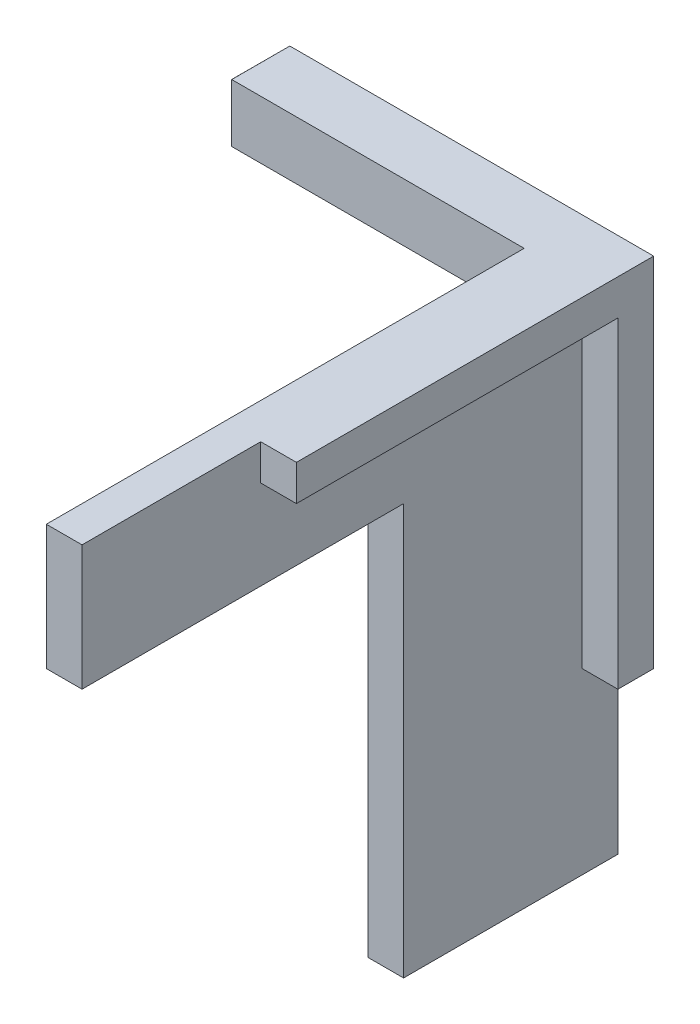
ISO-10303-21;
HEADER;
FILE_DESCRIPTION(('STEP AP214'),'2;1');
FILE_NAME('part.step','',(''),(''),'','','');
FILE_SCHEMA(('AUTOMOTIVE_DESIGN { 1 0 10303 214 1 1 1 1 }'));
ENDSEC;
DATA;
#1=APPLICATION_CONTEXT('core data for automotive mechanical design processes');
#2=APPLICATION_PROTOCOL_DEFINITION('international standard','automotive_design',2000,#1);
#3=PRODUCT_CONTEXT('',#1,'mechanical');
#4=PRODUCT('Part','Part','',(#3));
#5=PRODUCT_RELATED_PRODUCT_CATEGORY('part','',(#4));
#6=PRODUCT_DEFINITION_FORMATION('','',#4);
#7=PRODUCT_DEFINITION_CONTEXT('part definition',#1,'design');
#8=PRODUCT_DEFINITION('design','',#6,#7);
#9=PRODUCT_DEFINITION_SHAPE('','',#8);
#10=(LENGTH_UNIT() NAMED_UNIT(*) SI_UNIT(.MILLI.,.METRE.));
#11=(NAMED_UNIT(*) PLANE_ANGLE_UNIT() SI_UNIT($,.RADIAN.));
#12=(NAMED_UNIT(*) SI_UNIT($,.STERADIAN.) SOLID_ANGLE_UNIT());
#13=UNCERTAINTY_MEASURE_WITH_UNIT(LENGTH_MEASURE(1.E-05),#10,'distance_accuracy_value','');
#14=(GEOMETRIC_REPRESENTATION_CONTEXT(3) GLOBAL_UNCERTAINTY_ASSIGNED_CONTEXT((#13)) GLOBAL_UNIT_ASSIGNED_CONTEXT((#10,
#11,#12)) REPRESENTATION_CONTEXT('',''));
#15=CARTESIAN_POINT('',(0.,0.,0.));
#16=DIRECTION('',(0.,0.,1.));
#17=DIRECTION('',(1.,0.,0.));
#18=AXIS2_PLACEMENT_3D('',#15,#16,#17);
#19=CARTESIAN_POINT('',(168.563384776703,6.86000000004866,-0.499999999998285));
#20=DIRECTION('',(-1.,-2.88657986402541E-13,0.));
#21=DIRECTION('',(2.88657986402541E-13,-1.,0.));
#22=AXIS2_PLACEMENT_3D('',#19,#20,#21);
#23=PLANE('',#22);
#24=DIRECTION('',(0.,0.,-1.));
#25=VECTOR('',#24,1.);
#26=CARTESIAN_POINT('',(168.56338477669,54.0794739282967,-31.5542925575226));
#27=LINE('',#26,#25);
#28=CARTESIAN_POINT('',(168.56338477669,54.0794739282967,-31.5542925575226));
#29=VERTEX_POINT('',#28);
#30=CARTESIAN_POINT('',(168.56338477669,54.0794739282967,-33.5542925575226));
#31=VERTEX_POINT('',#30);
#32=EDGE_CURVE('E249',#29,#31,#27,.T.);
#33=ORIENTED_EDGE('',*,*,#32,.F.);
#34=DIRECTION('',(2.88349591117923E-13,-1.,0.));
#35=VECTOR('',#34,1.);
#36=CARTESIAN_POINT('',(168.563384776685,72.0794739282967,-31.5542925575226));
#37=LINE('',#36,#35);
#38=CARTESIAN_POINT('',(168.563384776685,72.0794739282967,-31.5542925575226));
#39=VERTEX_POINT('',#38);
#40=EDGE_CURVE('E272',#39,#29,#37,.T.);
#41=ORIENTED_EDGE('',*,*,#40,.F.);
#42=DIRECTION('',(0.,0.,-1.));
#43=VECTOR('',#42,1.);
#44=CARTESIAN_POINT('',(168.563384776684,72.0794739282967,-13.5542925575226));
#45=LINE('',#44,#43);
#46=CARTESIAN_POINT('',(168.563384776684,72.0794739282967,-13.5542925575226));
#47=VERTEX_POINT('',#46);
#48=EDGE_CURVE('E268',#47,#39,#45,.T.);
#49=ORIENTED_EDGE('',*,*,#48,.F.);
#50=DIRECTION('',(2.91433543964103E-13,-1.,0.));
#51=VECTOR('',#50,1.);
#52=CARTESIAN_POINT('',(168.563384776684,74.0794739282967,-13.5542925575226));
#53=LINE('',#52,#51);
#54=CARTESIAN_POINT('',(168.563384776684,74.0794739282967,-13.5542925575226));
#55=VERTEX_POINT('',#54);
#56=EDGE_CURVE('E220',#55,#47,#53,.T.);
#57=ORIENTED_EDGE('',*,*,#56,.F.);
#58=DIRECTION('',(0.,0.,1.));
#59=VECTOR('',#58,1.);
#60=CARTESIAN_POINT('',(168.563384776684,74.0794739282967,-3.55429255752262));
#61=LINE('',#60,#59);
#62=CARTESIAN_POINT('',(168.563384776684,74.0794739282967,-3.55429255752262));
#63=VERTEX_POINT('',#62);
#64=EDGE_CURVE('E300',#55,#63,#61,.T.);
#65=ORIENTED_EDGE('',*,*,#64,.T.);
#66=DIRECTION('',(2.88657986402541E-13,-1.,0.));
#67=VECTOR('',#66,1.);
#68=CARTESIAN_POINT('',(168.563384776687,64.0794739282967,-3.55429255752262));
#69=LINE('',#68,#67);
#70=CARTESIAN_POINT('',(168.563384776686,67.0794739282967,-3.55429255752262));
#71=VERTEX_POINT('',#70);
#72=EDGE_CURVE('E184',#63,#71,#69,.T.);
#73=ORIENTED_EDGE('',*,*,#72,.T.);
#74=DIRECTION('',(0.,0.,-1.));
#75=VECTOR('',#74,1.);
#76=CARTESIAN_POINT('',(168.563384776686,67.0794739282967,-3.55429255752262));
#77=LINE('',#76,#75);
#78=CARTESIAN_POINT('',(168.563384776686,67.0794739282967,-21.5542925575226));
#79=VERTEX_POINT('',#78);
#80=EDGE_CURVE('E164',#71,#79,#77,.T.);
#81=ORIENTED_EDGE('',*,*,#80,.T.);
#82=DIRECTION('',(2.88657986402541E-13,-1.,0.));
#83=VECTOR('',#82,1.);
#84=CARTESIAN_POINT('',(168.563384776687,64.0794739282967,-21.5542925575226));
#85=LINE('',#84,#83);
#86=CARTESIAN_POINT('',(168.563384776693,44.0794739282967,-21.5542925575226));
#87=VERTEX_POINT('',#86);
#88=EDGE_CURVE('E176',#79,#87,#85,.T.);
#89=ORIENTED_EDGE('',*,*,#88,.T.);
#90=DIRECTION('',(0.,0.,-1.));
#91=VECTOR('',#90,1.);
#92=CARTESIAN_POINT('',(168.563384776693,44.0794739282967,-33.5542925575226));
#93=LINE('',#92,#91);
#94=CARTESIAN_POINT('',(168.563384776693,44.0794739282967,-33.5542925575226));
#95=VERTEX_POINT('',#94);
#96=EDGE_CURVE('E181',#87,#95,#93,.T.);
#97=ORIENTED_EDGE('',*,*,#96,.T.);
#98=DIRECTION('',(-2.87732800548686E-13,1.,0.));
#99=VECTOR('',#98,1.);
#100=CARTESIAN_POINT('',(168.563384776684,74.0794739282967,-33.5542925575226));
#101=LINE('',#100,#99);
#102=EDGE_CURVE('E311',#95,#31,#101,.T.);
#103=ORIENTED_EDGE('',*,*,#102,.T.);
#104=EDGE_LOOP('',(#33,#41,#49,#57,#65,#73,#81,#89,#97,#103));
#105=FACE_BOUND('',#104,.T.);
#106=ADVANCED_FACE('F47',(#105),#23,.F.);
#107=CARTESIAN_POINT('',(166.563384776687,64.0794739282961,-3.55429255752264));
#108=DIRECTION('',(0.,0.,1.));
#109=DIRECTION('',(1.,0.,0.));
#110=AXIS2_PLACEMENT_3D('',#107,#108,#109);
#111=PLANE('',#110);
#112=ORIENTED_EDGE('',*,*,#72,.F.);
#113=DIRECTION('',(1.,2.87857945530399E-13,0.));
#114=VECTOR('',#113,1.);
#115=CARTESIAN_POINT('',(166.563384776684,74.0794739282961,-3.55429255752264));
#116=LINE('',#115,#114);
#117=CARTESIAN_POINT('',(166.563384776684,74.0794739282961,-3.55429255752264));
#118=VERTEX_POINT('',#117);
#119=EDGE_CURVE('E11',#118,#63,#116,.T.);
#120=ORIENTED_EDGE('',*,*,#119,.F.);
#121=DIRECTION('',(2.88657986402541E-13,-1.,0.));
#122=VECTOR('',#121,1.);
#123=CARTESIAN_POINT('',(166.563384776687,64.0794739282961,-3.55429255752264));
#124=LINE('',#123,#122);
#125=CARTESIAN_POINT('',(166.563384776686,67.0794739282961,-3.55429255752264));
#126=VERTEX_POINT('',#125);
#127=EDGE_CURVE('E196',#118,#126,#124,.T.);
#128=ORIENTED_EDGE('',*,*,#127,.T.);
#129=DIRECTION('',(1.,2.87857945530399E-13,0.));
#130=VECTOR('',#129,1.);
#131=CARTESIAN_POINT('',(166.563384776686,67.0794739282961,-3.55429255752264));
#132=LINE('',#131,#130);
#133=EDGE_CURVE('E173',#126,#71,#132,.T.);
#134=ORIENTED_EDGE('',*,*,#133,.T.);
#135=EDGE_LOOP('',(#112,#120,#128,#134));
#136=FACE_BOUND('',#135,.T.);
#137=ADVANCED_FACE('F322',(#136),#111,.T.);
#138=CARTESIAN_POINT('',(166.563384776684,74.0794739282961,-3.55429255752264));
#139=DIRECTION('',(-2.87857945530399E-13,1.,0.));
#140=DIRECTION('',(-1.,-2.87857945530399E-13,0.));
#141=AXIS2_PLACEMENT_3D('',#138,#139,#140);
#142=PLANE('',#141);
#143=ORIENTED_EDGE('',*,*,#64,.F.);
#144=DIRECTION('',(-1.,-2.88657986402541E-13,0.));
#145=VECTOR('',#144,1.);
#146=CARTESIAN_POINT('',(170.563384776684,74.0794739282972,-13.5542925575226));
#147=LINE('',#146,#145);
#148=CARTESIAN_POINT('',(170.563384776684,74.0794739282972,-13.5542925575226));
#149=VERTEX_POINT('',#148);
#150=EDGE_CURVE('E188',#149,#55,#147,.T.);
#151=ORIENTED_EDGE('',*,*,#150,.F.);
#152=DIRECTION('',(0.,0.,1.));
#153=VECTOR('',#152,1.);
#154=CARTESIAN_POINT('',(170.563384776684,74.0794739282972,-33.5542925575226));
#155=LINE('',#154,#153);
#156=CARTESIAN_POINT('',(170.563384776684,74.0794739282972,-33.5542925575226));
#157=VERTEX_POINT('',#156);
#158=EDGE_CURVE('E248',#157,#149,#155,.T.);
#159=ORIENTED_EDGE('',*,*,#158,.F.);
#160=DIRECTION('',(1.,2.87857945530399E-13,0.));
#161=VECTOR('',#160,1.);
#162=CARTESIAN_POINT('',(166.563384776684,74.0794739282961,-33.5542925575226));
#163=LINE('',#162,#161);
#164=CARTESIAN_POINT('',(150.193384776684,74.0794739282914,-33.5542925575228));
#165=VERTEX_POINT('',#164);
#166=EDGE_CURVE('E58',#165,#157,#163,.T.);
#167=ORIENTED_EDGE('',*,*,#166,.F.);
#168=DIRECTION('',(0.,0.,1.));
#169=VECTOR('',#168,1.);
#170=CARTESIAN_POINT('',(150.193384776684,74.0794739282916,6.47011348892838E-13));
#171=LINE('',#170,#169);
#172=CARTESIAN_POINT('',(150.193384776684,74.0794739282916,-30.3042925575226));
#173=VERTEX_POINT('',#172);
#174=EDGE_CURVE('E212',#173,#165,#171,.F.);
#175=ORIENTED_EDGE('',*,*,#174,.F.);
#176=DIRECTION('',(1.,2.88657986402541E-13,0.));
#177=VECTOR('',#176,1.);
#178=CARTESIAN_POINT('',(148.563384776684,74.0794739282909,-30.3042925575228));
#179=LINE('',#178,#177);
#180=CARTESIAN_POINT('',(166.563384776684,74.0794739282961,-30.3042925575226));
#181=VERTEX_POINT('',#180);
#182=EDGE_CURVE('E207',#173,#181,#179,.T.);
#183=ORIENTED_EDGE('',*,*,#182,.T.);
#184=DIRECTION('',(0.,0.,1.));
#185=VECTOR('',#184,1.);
#186=CARTESIAN_POINT('',(166.563384776684,74.0794739282961,-3.55429255752264));
#187=LINE('',#186,#185);
#188=EDGE_CURVE('E198',#181,#118,#187,.T.);
#189=ORIENTED_EDGE('',*,*,#188,.T.);
#190=ORIENTED_EDGE('',*,*,#119,.T.);
#191=EDGE_LOOP('',(#143,#151,#159,#167,#175,#183,#189,#190));
#192=FACE_BOUND('',#191,.T.);
#193=ADVANCED_FACE('F319',(#192),#142,.T.);
#194=CARTESIAN_POINT('',(166.563384776684,74.0794739282961,-33.5542925575226));
#195=DIRECTION('',(0.,0.,-1.));
#196=DIRECTION('',(-1.,0.,0.));
#197=AXIS2_PLACEMENT_3D('',#194,#195,#196);
#198=PLANE('',#197);
#199=ORIENTED_EDGE('',*,*,#102,.F.);
#200=DIRECTION('',(1.,2.87857945530399E-13,0.));
#201=VECTOR('',#200,1.);
#202=CARTESIAN_POINT('',(166.563384776693,44.0794739282961,-33.5542925575226));
#203=LINE('',#202,#201);
#204=CARTESIAN_POINT('',(166.563384776693,44.0794739282961,-33.5542925575226));
#205=VERTEX_POINT('',#204);
#206=EDGE_CURVE('E192',#205,#95,#203,.T.);
#207=ORIENTED_EDGE('',*,*,#206,.F.);
#208=DIRECTION('',(-2.87732800548686E-13,1.,0.));
#209=VECTOR('',#208,1.);
#210=CARTESIAN_POINT('',(166.563384776684,74.0794739282961,-33.5542925575226));
#211=LINE('',#210,#209);
#212=CARTESIAN_POINT('',(166.563384776685,70.8294739282961,-33.5542925575226));
#213=VERTEX_POINT('',#212);
#214=EDGE_CURVE('E304',#205,#213,#211,.T.);
#215=ORIENTED_EDGE('',*,*,#214,.T.);
#216=DIRECTION('',(1.,2.88657986402541E-13,0.));
#217=VECTOR('',#216,1.);
#218=CARTESIAN_POINT('',(148.563384776685,70.8294739282909,-33.5542925575228));
#219=LINE('',#218,#217);
#220=CARTESIAN_POINT('',(150.193384776685,70.8294739282916,-33.5542925575226));
#221=VERTEX_POINT('',#220);
#222=EDGE_CURVE('E216',#221,#213,#219,.T.);
#223=ORIENTED_EDGE('',*,*,#222,.F.);
#224=DIRECTION('',(-1.45775502450499E-13,1.,-1.46224042458041E-13));
#225=VECTOR('',#224,1.);
#226=CARTESIAN_POINT('',(150.193384776695,1.69880718309847E-11,-33.554292557512));
#227=LINE('',#226,#225);
#228=EDGE_CURVE('E51',#165,#221,#227,.F.);
#229=ORIENTED_EDGE('',*,*,#228,.F.);
#230=ORIENTED_EDGE('',*,*,#166,.T.);
#231=DIRECTION('',(-2.88657986402541E-13,1.,0.));
#232=VECTOR('',#231,1.);
#233=CARTESIAN_POINT('',(170.563384776684,74.0794739282972,-33.5542925575226));
#234=LINE('',#233,#232);
#235=CARTESIAN_POINT('',(170.56338477669,54.0794739282972,-33.5542925575226));
#236=VERTEX_POINT('',#235);
#237=EDGE_CURVE('E244',#236,#157,#234,.T.);
#238=ORIENTED_EDGE('',*,*,#237,.F.);
#239=DIRECTION('',(-1.,-2.88657986402541E-13,0.));
#240=VECTOR('',#239,1.);
#241=CARTESIAN_POINT('',(170.56338477669,54.0794739282972,-33.5542925575226));
#242=LINE('',#241,#240);
#243=EDGE_CURVE('E264',#236,#31,#242,.T.);
#244=ORIENTED_EDGE('',*,*,#243,.T.);
#245=EDGE_LOOP('',(#199,#207,#215,#223,#229,#230,#238,#244));
#246=FACE_BOUND('',#245,.T.);
#247=ADVANCED_FACE('F334',(#246),#198,.T.);
#248=CARTESIAN_POINT('',(166.563384776693,44.0794739282961,-33.5542925575226));
#249=DIRECTION('',(2.87857945530399E-13,-1.,0.));
#250=DIRECTION('',(1.,2.87857945530399E-13,0.));
#251=AXIS2_PLACEMENT_3D('',#248,#249,#250);
#252=PLANE('',#251);
#253=ORIENTED_EDGE('',*,*,#96,.F.);
#254=DIRECTION('',(1.,2.87857945530399E-13,0.));
#255=VECTOR('',#254,1.);
#256=CARTESIAN_POINT('',(166.563384776693,44.0794739282961,-21.5542925575226));
#257=LINE('',#256,#255);
#258=CARTESIAN_POINT('',(166.563384776693,44.0794739282961,-21.5542925575226));
#259=VERTEX_POINT('',#258);
#260=EDGE_CURVE('E172',#259,#87,#257,.T.);
#261=ORIENTED_EDGE('',*,*,#260,.F.);
#262=DIRECTION('',(0.,0.,-1.));
#263=VECTOR('',#262,1.);
#264=CARTESIAN_POINT('',(166.563384776693,44.0794739282961,-33.5542925575226));
#265=LINE('',#264,#263);
#266=EDGE_CURVE('E203',#259,#205,#265,.T.);
#267=ORIENTED_EDGE('',*,*,#266,.T.);
#268=ORIENTED_EDGE('',*,*,#206,.T.);
#269=EDGE_LOOP('',(#253,#261,#267,#268));
#270=FACE_BOUND('',#269,.T.);
#271=ADVANCED_FACE('F326',(#270),#252,.T.);
#272=CARTESIAN_POINT('',(166.563384776687,64.0794739282961,-21.5542925575226));
#273=DIRECTION('',(0.,0.,1.));
#274=DIRECTION('',(1.,0.,0.));
#275=AXIS2_PLACEMENT_3D('',#272,#273,#274);
#276=PLANE('',#275);
#277=ORIENTED_EDGE('',*,*,#88,.F.);
#278=DIRECTION('',(1.,2.87857945530399E-13,0.));
#279=VECTOR('',#278,1.);
#280=CARTESIAN_POINT('',(166.563384776686,67.0794739282961,-21.5542925575226));
#281=LINE('',#280,#279);
#282=CARTESIAN_POINT('',(166.563384776686,67.0794739282961,-21.5542925575226));
#283=VERTEX_POINT('',#282);
#284=EDGE_CURVE('E160',#283,#79,#281,.T.);
#285=ORIENTED_EDGE('',*,*,#284,.F.);
#286=DIRECTION('',(2.88657986402541E-13,-1.,0.));
#287=VECTOR('',#286,1.);
#288=CARTESIAN_POINT('',(166.563384776687,64.0794739282961,-21.5542925575226));
#289=LINE('',#288,#287);
#290=EDGE_CURVE('E195',#283,#259,#289,.T.);
#291=ORIENTED_EDGE('',*,*,#290,.T.);
#292=ORIENTED_EDGE('',*,*,#260,.T.);
#293=EDGE_LOOP('',(#277,#285,#291,#292));
#294=FACE_BOUND('',#293,.T.);
#295=ADVANCED_FACE('F49',(#294),#276,.T.);
#296=CARTESIAN_POINT('',(166.563384776686,67.0794739282961,-3.55429255752264));
#297=DIRECTION('',(2.87857945530399E-13,-1.,0.));
#298=DIRECTION('',(1.,2.87857945530399E-13,0.));
#299=AXIS2_PLACEMENT_3D('',#296,#297,#298);
#300=PLANE('',#299);
#301=ORIENTED_EDGE('',*,*,#80,.F.);
#302=ORIENTED_EDGE('',*,*,#133,.F.);
#303=DIRECTION('',(0.,0.,-1.));
#304=VECTOR('',#303,1.);
#305=CARTESIAN_POINT('',(166.563384776686,67.0794739282961,-3.55429255752264));
#306=LINE('',#305,#304);
#307=EDGE_CURVE('E167',#126,#283,#306,.T.);
#308=ORIENTED_EDGE('',*,*,#307,.T.);
#309=ORIENTED_EDGE('',*,*,#284,.T.);
#310=EDGE_LOOP('',(#301,#302,#308,#309));
#311=FACE_BOUND('',#310,.T.);
#312=ADVANCED_FACE('F162',(#311),#300,.T.);
#313=CARTESIAN_POINT('',(166.563384776703,6.86000000004808,-0.499999999998305));
#314=DIRECTION('',(-1.,-2.88657986402541E-13,0.));
#315=DIRECTION('',(2.88657986402541E-13,-1.,0.));
#316=AXIS2_PLACEMENT_3D('',#313,#314,#315);
#317=PLANE('',#316);
#318=DIRECTION('',(-2.81825844712539E-13,1.,0.));
#319=VECTOR('',#318,1.);
#320=CARTESIAN_POINT('',(166.563384776684,74.0794739282961,-30.3042925575226));
#321=LINE('',#320,#319);
#322=CARTESIAN_POINT('',(166.563384776685,70.8294739282961,-30.3042925575226));
#323=VERTEX_POINT('',#322);
#324=EDGE_CURVE('E231',#323,#181,#321,.T.);
#325=ORIENTED_EDGE('',*,*,#324,.F.);
#326=DIRECTION('',(0.,0.,1.));
#327=VECTOR('',#326,1.);
#328=CARTESIAN_POINT('',(166.563384776685,70.8294739282961,-33.5542925575226));
#329=LINE('',#328,#327);
#330=EDGE_CURVE('E67',#213,#323,#329,.T.);
#331=ORIENTED_EDGE('',*,*,#330,.F.);
#332=ORIENTED_EDGE('',*,*,#214,.F.);
#333=ORIENTED_EDGE('',*,*,#266,.F.);
#334=ORIENTED_EDGE('',*,*,#290,.F.);
#335=ORIENTED_EDGE('',*,*,#307,.F.);
#336=ORIENTED_EDGE('',*,*,#127,.F.);
#337=ORIENTED_EDGE('',*,*,#188,.F.);
#338=EDGE_LOOP('',(#325,#331,#332,#333,#334,#335,#336,#337));
#339=FACE_BOUND('',#338,.T.);
#340=ADVANCED_FACE('F323',(#339),#317,.T.);
#341=CARTESIAN_POINT('',(170.563384776684,74.0794739282972,-13.5542925575226));
#342=DIRECTION('',(0.,0.,-1.));
#343=DIRECTION('',(-1.,0.,0.));
#344=AXIS2_PLACEMENT_3D('',#341,#342,#343);
#345=PLANE('',#344);
#346=ORIENTED_EDGE('',*,*,#56,.T.);
#347=DIRECTION('',(-1.,-2.88657986402541E-13,0.));
#348=VECTOR('',#347,1.);
#349=CARTESIAN_POINT('',(170.563384776684,72.0794739282972,-13.5542925575226));
#350=LINE('',#349,#348);
#351=CARTESIAN_POINT('',(170.563384776684,72.0794739282972,-13.5542925575226));
#352=VERTEX_POINT('',#351);
#353=EDGE_CURVE('E290',#352,#47,#350,.T.);
#354=ORIENTED_EDGE('',*,*,#353,.F.);
#355=DIRECTION('',(2.91433543964103E-13,-1.,0.));
#356=VECTOR('',#355,1.);
#357=CARTESIAN_POINT('',(170.563384776684,74.0794739282972,-13.5542925575226));
#358=LINE('',#357,#356);
#359=EDGE_CURVE('E252',#149,#352,#358,.T.);
#360=ORIENTED_EDGE('',*,*,#359,.F.);
#361=ORIENTED_EDGE('',*,*,#150,.T.);
#362=EDGE_LOOP('',(#346,#354,#360,#361));
#363=FACE_BOUND('',#362,.T.);
#364=ADVANCED_FACE('F348',(#363),#345,.F.);
#365=CARTESIAN_POINT('',(170.563384776684,72.0794739282972,-13.5542925575226));
#366=DIRECTION('',(-2.88657986402541E-13,1.,0.));
#367=DIRECTION('',(-1.,-2.88657986402541E-13,0.));
#368=AXIS2_PLACEMENT_3D('',#365,#366,#367);
#369=PLANE('',#368);
#370=ORIENTED_EDGE('',*,*,#48,.T.);
#371=DIRECTION('',(-1.,-2.88657986402541E-13,0.));
#372=VECTOR('',#371,1.);
#373=CARTESIAN_POINT('',(170.563384776685,72.0794739282972,-31.5542925575226));
#374=LINE('',#373,#372);
#375=CARTESIAN_POINT('',(170.563384776685,72.0794739282972,-31.5542925575226));
#376=VERTEX_POINT('',#375);
#377=EDGE_CURVE('E286',#376,#39,#374,.T.);
#378=ORIENTED_EDGE('',*,*,#377,.F.);
#379=DIRECTION('',(0.,0.,-1.));
#380=VECTOR('',#379,1.);
#381=CARTESIAN_POINT('',(170.563384776684,72.0794739282972,-13.5542925575226));
#382=LINE('',#381,#380);
#383=EDGE_CURVE('E255',#352,#376,#382,.T.);
#384=ORIENTED_EDGE('',*,*,#383,.F.);
#385=ORIENTED_EDGE('',*,*,#353,.T.);
#386=EDGE_LOOP('',(#370,#378,#384,#385));
#387=FACE_BOUND('',#386,.T.);
#388=ADVANCED_FACE('F344',(#387),#369,.F.);
#389=CARTESIAN_POINT('',(170.563384776685,72.0794739282972,-31.5542925575226));
#390=DIRECTION('',(0.,0.,-1.));
#391=DIRECTION('',(-1.,0.,0.));
#392=AXIS2_PLACEMENT_3D('',#389,#390,#391);
#393=PLANE('',#392);
#394=ORIENTED_EDGE('',*,*,#40,.T.);
#395=DIRECTION('',(-1.,-2.88657986402541E-13,0.));
#396=VECTOR('',#395,1.);
#397=CARTESIAN_POINT('',(170.56338477669,54.0794739282972,-31.5542925575226));
#398=LINE('',#397,#396);
#399=CARTESIAN_POINT('',(170.56338477669,54.0794739282972,-31.5542925575226));
#400=VERTEX_POINT('',#399);
#401=EDGE_CURVE('E282',#400,#29,#398,.T.);
#402=ORIENTED_EDGE('',*,*,#401,.F.);
#403=DIRECTION('',(2.88349591117923E-13,-1.,0.));
#404=VECTOR('',#403,1.);
#405=CARTESIAN_POINT('',(170.563384776685,72.0794739282972,-31.5542925575226));
#406=LINE('',#405,#404);
#407=EDGE_CURVE('E258',#376,#400,#406,.T.);
#408=ORIENTED_EDGE('',*,*,#407,.F.);
#409=ORIENTED_EDGE('',*,*,#377,.T.);
#410=EDGE_LOOP('',(#394,#402,#408,#409));
#411=FACE_BOUND('',#410,.T.);
#412=ADVANCED_FACE('F342',(#411),#393,.F.);
#413=CARTESIAN_POINT('',(170.56338477669,54.0794739282972,-31.5542925575226));
#414=DIRECTION('',(-2.88657986402541E-13,1.,0.));
#415=DIRECTION('',(-1.,-2.88657986402541E-13,0.));
#416=AXIS2_PLACEMENT_3D('',#413,#414,#415);
#417=PLANE('',#416);
#418=ORIENTED_EDGE('',*,*,#32,.T.);
#419=ORIENTED_EDGE('',*,*,#243,.F.);
#420=DIRECTION('',(0.,0.,-1.));
#421=VECTOR('',#420,1.);
#422=CARTESIAN_POINT('',(170.56338477669,54.0794739282972,-31.5542925575226));
#423=LINE('',#422,#421);
#424=EDGE_CURVE('E261',#400,#236,#423,.T.);
#425=ORIENTED_EDGE('',*,*,#424,.F.);
#426=ORIENTED_EDGE('',*,*,#401,.T.);
#427=EDGE_LOOP('',(#418,#419,#425,#426));
#428=FACE_BOUND('',#427,.T.);
#429=ADVANCED_FACE('F330',(#428),#417,.F.);
#430=CARTESIAN_POINT('',(170.563384776703,6.86000000004923,-0.49999999999764));
#431=DIRECTION('',(1.,2.88657986402541E-13,0.));
#432=DIRECTION('',(-2.88657986402541E-13,1.,0.));
#433=AXIS2_PLACEMENT_3D('',#430,#431,#432);
#434=PLANE('',#433);
#435=ORIENTED_EDGE('',*,*,#237,.T.);
#436=ORIENTED_EDGE('',*,*,#158,.T.);
#437=ORIENTED_EDGE('',*,*,#359,.T.);
#438=ORIENTED_EDGE('',*,*,#383,.T.);
#439=ORIENTED_EDGE('',*,*,#407,.T.);
#440=ORIENTED_EDGE('',*,*,#424,.T.);
#441=EDGE_LOOP('',(#435,#436,#437,#438,#439,#440));
#442=FACE_BOUND('',#441,.T.);
#443=ADVANCED_FACE('F337',(#442),#434,.T.);
#444=CARTESIAN_POINT('',(148.563384776685,70.8294739282909,-33.5542925575228));
#445=DIRECTION('',(-2.88657986402541E-13,1.,0.));
#446=DIRECTION('',(-1.,-2.88657986402541E-13,0.));
#447=AXIS2_PLACEMENT_3D('',#444,#445,#446);
#448=PLANE('',#447);
#449=ORIENTED_EDGE('',*,*,#330,.T.);
#450=DIRECTION('',(1.,2.88657986402541E-13,0.));
#451=VECTOR('',#450,1.);
#452=CARTESIAN_POINT('',(148.563384776685,70.8294739282909,-30.3042925575228));
#453=LINE('',#452,#451);
#454=CARTESIAN_POINT('',(150.193384776685,70.8294739282914,-30.3042925575228));
#455=VERTEX_POINT('',#454);
#456=EDGE_CURVE('E211',#455,#323,#453,.T.);
#457=ORIENTED_EDGE('',*,*,#456,.F.);
#458=DIRECTION('',(0.,0.,1.));
#459=VECTOR('',#458,1.);
#460=CARTESIAN_POINT('',(150.193384776685,70.8294739282911,1.88632098926515E-12));
#461=LINE('',#460,#459);
#462=EDGE_CURVE('E227',#221,#455,#461,.T.);
#463=ORIENTED_EDGE('',*,*,#462,.F.);
#464=ORIENTED_EDGE('',*,*,#222,.T.);
#465=EDGE_LOOP('',(#449,#457,#463,#464));
#466=FACE_BOUND('',#465,.T.);
#467=ADVANCED_FACE('F369',(#466),#448,.F.);
#468=CARTESIAN_POINT('',(148.563384776684,74.0794739282909,-30.3042925575228));
#469=DIRECTION('',(0.,0.,-1.));
#470=DIRECTION('',(-1.,0.,0.));
#471=AXIS2_PLACEMENT_3D('',#468,#469,#470);
#472=PLANE('',#471);
#473=ORIENTED_EDGE('',*,*,#324,.T.);
#474=ORIENTED_EDGE('',*,*,#182,.F.);
#475=DIRECTION('',(-1.44236645505945E-13,1.,1.44680450569037E-13));
#476=VECTOR('',#475,1.);
#477=CARTESIAN_POINT('',(150.193384776695,2.60478286987739E-11,-30.3042925575331));
#478=LINE('',#477,#476);
#479=EDGE_CURVE('E224',#455,#173,#478,.T.);
#480=ORIENTED_EDGE('',*,*,#479,.F.);
#481=ORIENTED_EDGE('',*,*,#456,.T.);
#482=EDGE_LOOP('',(#473,#474,#480,#481));
#483=FACE_BOUND('',#482,.T.);
#484=ADVANCED_FACE('F367',(#483),#472,.F.);
#485=CARTESIAN_POINT('',(90.0180559011491,2.60478286987739E-11,-90.2950345346892));
#486=DIRECTION('',(0.706019762693853,2.04295478862522E-13,-0.708192131194434));
#487=DIRECTION('',(-0.708192131194434,0.,-0.706019762693853));
#488=AXIS2_PLACEMENT_3D('',#485,#486,#487);
#489=PLANE('',#488);
#490=DIRECTION('',(-0.578532756668726,-0.576758116311026,-0.576758116311025));
#491=VECTOR('',#490,1.);
#492=CARTESIAN_POINT('',(150.193384776684,74.0794739282914,-30.3042925575228));
#493=LINE('',#492,#491);
#494=CARTESIAN_POINT('',(148.563384776685,72.4544739282914,-31.9292925575228));
#495=VERTEX_POINT('',#494);
#496=EDGE_CURVE('E355',#173,#495,#493,.T.);
#497=ORIENTED_EDGE('',*,*,#496,.T.);
#498=DIRECTION('',(-0.578532756668948,0.576758116310914,-0.576758116310914));
#499=VECTOR('',#498,1.);
#500=CARTESIAN_POINT('',(150.193384776685,70.8294739282914,-30.3042925575228));
#501=LINE('',#500,#499);
#502=EDGE_CURVE('E95',#455,#495,#501,.T.);
#503=ORIENTED_EDGE('',*,*,#502,.F.);
#504=ORIENTED_EDGE('',*,*,#479,.T.);
#505=EDGE_LOOP('',(#497,#503,#504));
#506=FACE_BOUND('',#505,.T.);
#507=ADVANCED_FACE('F365',(#506),#489,.F.);
#508=CARTESIAN_POINT('',(110.280550963588,110.619875735815,1.88632098926515E-12));
#509=DIRECTION('',(0.706019762693745,0.708192131194542,0.));
#510=DIRECTION('',(-0.708192131194542,0.706019762693745,0.));
#511=AXIS2_PLACEMENT_3D('',#508,#509,#510);
#512=PLANE('',#511);
#513=ORIENTED_EDGE('',*,*,#502,.T.);
#514=DIRECTION('',(-0.578532756668961,0.576758116310907,0.576758116310907));
#515=VECTOR('',#514,1.);
#516=CARTESIAN_POINT('',(150.193384776685,70.8294739282914,-33.5542925575228));
#517=LINE('',#516,#515);
#518=EDGE_CURVE('E240',#221,#495,#517,.T.);
#519=ORIENTED_EDGE('',*,*,#518,.F.);
#520=ORIENTED_EDGE('',*,*,#462,.T.);
#521=EDGE_LOOP('',(#513,#519,#520));
#522=FACE_BOUND('',#521,.T.);
#523=ADVANCED_FACE('F465',(#522),#512,.F.);
#524=CARTESIAN_POINT('',(37.826418961399,-37.9428079428075,6.47011348892838E-13));
#525=DIRECTION('',(0.70601976269395,-0.708192131194338,0.));
#526=DIRECTION('',(0.708192131194338,0.70601976269395,0.));
#527=AXIS2_PLACEMENT_3D('',#524,#525,#526);
#528=PLANE('',#527);
#529=DIRECTION('',(-0.578532756668738,-0.576758116311018,0.576758116311021));
#530=VECTOR('',#529,1.);
#531=CARTESIAN_POINT('',(150.193384776684,74.0794739282914,-33.5542925575228));
#532=LINE('',#531,#530);
#533=EDGE_CURVE('E354',#165,#495,#532,.T.);
#534=ORIENTED_EDGE('',*,*,#533,.T.);
#535=ORIENTED_EDGE('',*,*,#496,.F.);
#536=ORIENTED_EDGE('',*,*,#174,.T.);
#537=EDGE_LOOP('',(#534,#535,#536));
#538=FACE_BOUND('',#537,.T.);
#539=ADVANCED_FACE('F353',(#538),#528,.F.);
#540=CARTESIAN_POINT('',(58.0889140238595,1.69880718309847E-11,58.2676491439335));
#541=DIRECTION('',(0.706019762693842,2.06475101906904E-13,0.708192131194445));
#542=DIRECTION('',(0.708192131194445,0.,-0.706019762693842));
#543=AXIS2_PLACEMENT_3D('',#540,#541,#542);
#544=PLANE('',#543);
#545=ORIENTED_EDGE('',*,*,#518,.T.);
#546=ORIENTED_EDGE('',*,*,#533,.F.);
#547=ORIENTED_EDGE('',*,*,#228,.T.);
#548=EDGE_LOOP('',(#545,#546,#547));
#549=FACE_BOUND('',#548,.T.);
#550=ADVANCED_FACE('F356',(#549),#544,.F.);
#551=CLOSED_SHELL('',(#106,#137,#193,#247,#271,#295,#312,#340,#364,#388,#412,#429,#443,#467,
#484,#507,#523,#539,#550));
#552=MANIFOLD_SOLID_BREP('B2',#551);
#553=ADVANCED_BREP_SHAPE_REPRESENTATION('',(#18,#552),#14);
#554=SHAPE_DEFINITION_REPRESENTATION(#9,#553);
ENDSEC;
END-ISO-10303-21;
